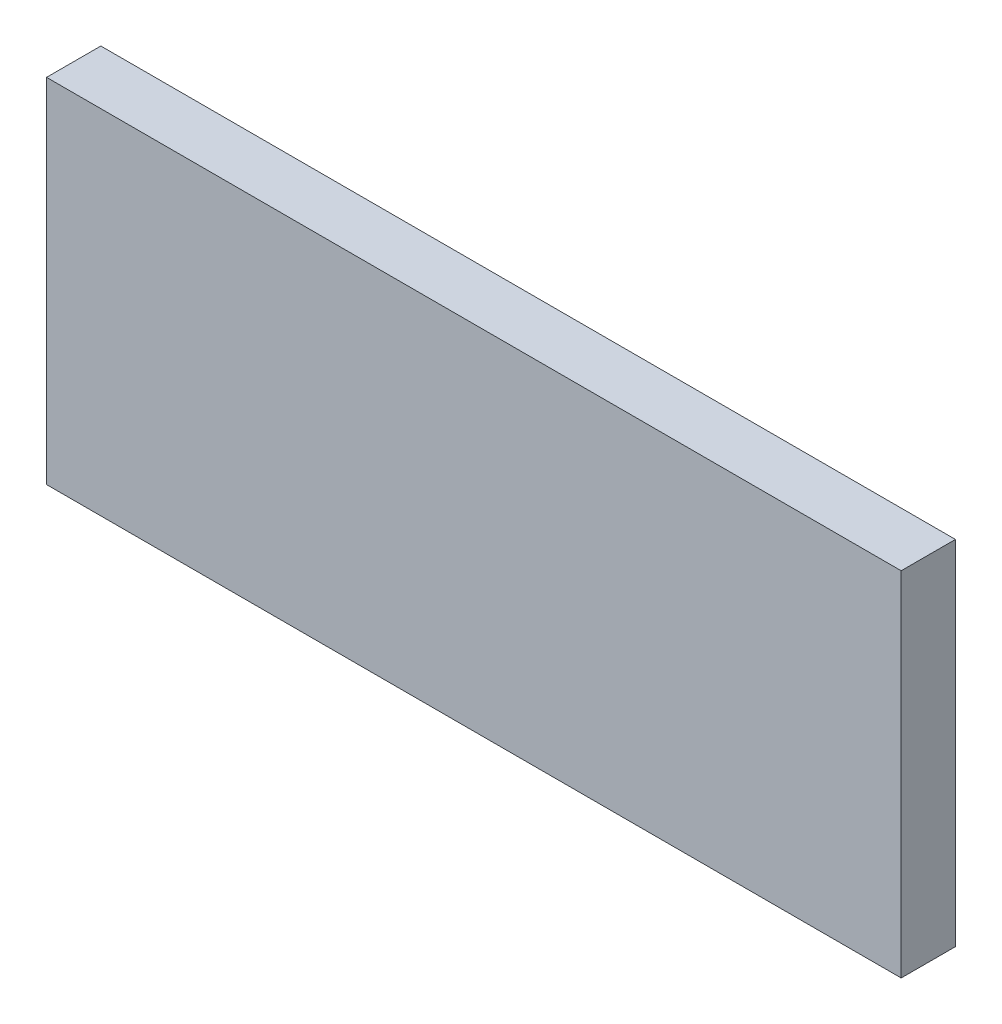
ISO-10303-21;
HEADER;
FILE_DESCRIPTION(('STEP AP214'),'2;1');
FILE_NAME('part.step','',(''),(''),'','','');
FILE_SCHEMA(('AUTOMOTIVE_DESIGN { 1 0 10303 214 1 1 1 1 }'));
ENDSEC;
DATA;
#1=APPLICATION_CONTEXT('core data for automotive mechanical design processes');
#2=APPLICATION_PROTOCOL_DEFINITION('international standard','automotive_design',2000,#1);
#3=PRODUCT_CONTEXT('',#1,'mechanical');
#4=PRODUCT('Part','Part','',(#3));
#5=PRODUCT_RELATED_PRODUCT_CATEGORY('part','',(#4));
#6=PRODUCT_DEFINITION_FORMATION('','',#4);
#7=PRODUCT_DEFINITION_CONTEXT('part definition',#1,'design');
#8=PRODUCT_DEFINITION('design','',#6,#7);
#9=PRODUCT_DEFINITION_SHAPE('','',#8);
#10=(LENGTH_UNIT() NAMED_UNIT(*) SI_UNIT(.MILLI.,.METRE.));
#11=(NAMED_UNIT(*) PLANE_ANGLE_UNIT() SI_UNIT($,.RADIAN.));
#12=(NAMED_UNIT(*) SI_UNIT($,.STERADIAN.) SOLID_ANGLE_UNIT());
#13=UNCERTAINTY_MEASURE_WITH_UNIT(LENGTH_MEASURE(1.E-05),#10,'distance_accuracy_value','');
#14=(GEOMETRIC_REPRESENTATION_CONTEXT(3) GLOBAL_UNCERTAINTY_ASSIGNED_CONTEXT((#13)) GLOBAL_UNIT_ASSIGNED_CONTEXT((#10,
#11,#12)) REPRESENTATION_CONTEXT('',''));
#15=CARTESIAN_POINT('',(0.,0.,0.));
#16=DIRECTION('',(0.,0.,1.));
#17=DIRECTION('',(1.,0.,0.));
#18=AXIS2_PLACEMENT_3D('',#15,#16,#17);
#19=CARTESIAN_POINT('',(-33.600853382098,9.35087719298246,4.));
#20=DIRECTION('',(1.,0.,0.));
#21=DIRECTION('',(0.,0.,-1.));
#22=AXIS2_PLACEMENT_3D('',#19,#20,#21);
#23=PLANE('',#22);
#24=DIRECTION('',(0.,-1.,0.));
#25=VECTOR('',#24,1.);
#26=CARTESIAN_POINT('',(-33.600853382098,9.35087719298246,0.));
#27=LINE('',#26,#25);
#28=CARTESIAN_POINT('',(-33.600853382098,9.35087719298246,0.));
#29=VERTEX_POINT('',#28);
#30=CARTESIAN_POINT('',(-33.600853382098,-16.6491228070175,0.));
#31=VERTEX_POINT('',#30);
#32=EDGE_CURVE('E96',#29,#31,#27,.T.);
#33=ORIENTED_EDGE('',*,*,#32,.T.);
#34=DIRECTION('',(0.,0.,-1.));
#35=VECTOR('',#34,1.);
#36=CARTESIAN_POINT('',(-33.600853382098,-16.6491228070175,4.));
#37=LINE('',#36,#35);
#38=CARTESIAN_POINT('',(-33.600853382098,-16.6491228070175,4.));
#39=VERTEX_POINT('',#38);
#40=EDGE_CURVE('E11',#39,#31,#37,.T.);
#41=ORIENTED_EDGE('',*,*,#40,.F.);
#42=DIRECTION('',(0.,-1.,0.));
#43=VECTOR('',#42,1.);
#44=CARTESIAN_POINT('',(-33.600853382098,9.35087719298246,4.));
#45=LINE('',#44,#43);
#46=CARTESIAN_POINT('',(-33.600853382098,9.35087719298246,4.));
#47=VERTEX_POINT('',#46);
#48=EDGE_CURVE('E84',#47,#39,#45,.T.);
#49=ORIENTED_EDGE('',*,*,#48,.F.);
#50=DIRECTION('',(0.,0.,-1.));
#51=VECTOR('',#50,1.);
#52=CARTESIAN_POINT('',(-33.600853382098,9.35087719298246,4.));
#53=LINE('',#52,#51);
#54=EDGE_CURVE('E92',#47,#29,#53,.T.);
#55=ORIENTED_EDGE('',*,*,#54,.T.);
#56=EDGE_LOOP('',(#33,#41,#49,#55));
#57=FACE_BOUND('',#56,.T.);
#58=ADVANCED_FACE('F33',(#57),#23,.F.);
#59=CARTESIAN_POINT('',(-33.600853382098,-16.6491228070175,4.));
#60=DIRECTION('',(0.,1.,0.));
#61=DIRECTION('',(0.,0.,1.));
#62=AXIS2_PLACEMENT_3D('',#59,#60,#61);
#63=PLANE('',#62);
#64=DIRECTION('',(1.,0.,0.));
#65=VECTOR('',#64,1.);
#66=CARTESIAN_POINT('',(-33.600853382098,-16.6491228070175,0.));
#67=LINE('',#66,#65);
#68=CARTESIAN_POINT('',(29.399146617902,-16.6491228070175,0.));
#69=VERTEX_POINT('',#68);
#70=EDGE_CURVE('E88',#31,#69,#67,.T.);
#71=ORIENTED_EDGE('',*,*,#70,.T.);
#72=DIRECTION('',(0.,0.,-1.));
#73=VECTOR('',#72,1.);
#74=CARTESIAN_POINT('',(29.399146617902,-16.6491228070175,4.));
#75=LINE('',#74,#73);
#76=CARTESIAN_POINT('',(29.399146617902,-16.6491228070175,4.));
#77=VERTEX_POINT('',#76);
#78=EDGE_CURVE('E41',#77,#69,#75,.T.);
#79=ORIENTED_EDGE('',*,*,#78,.F.);
#80=DIRECTION('',(1.,0.,0.));
#81=VECTOR('',#80,1.);
#82=CARTESIAN_POINT('',(-33.600853382098,-16.6491228070175,4.));
#83=LINE('',#82,#81);
#84=EDGE_CURVE('E79',#39,#77,#83,.T.);
#85=ORIENTED_EDGE('',*,*,#84,.F.);
#86=ORIENTED_EDGE('',*,*,#40,.T.);
#87=EDGE_LOOP('',(#71,#79,#85,#86));
#88=FACE_BOUND('',#87,.T.);
#89=ADVANCED_FACE('F87',(#88),#63,.F.);
#90=CARTESIAN_POINT('',(29.399146617902,9.35087719298246,4.));
#91=DIRECTION('',(-1.,0.,0.));
#92=DIRECTION('',(0.,0.,1.));
#93=AXIS2_PLACEMENT_3D('',#90,#91,#92);
#94=PLANE('',#93);
#95=DIRECTION('',(0.,1.,0.));
#96=VECTOR('',#95,1.);
#97=CARTESIAN_POINT('',(29.399146617902,9.35087719298246,0.));
#98=LINE('',#97,#96);
#99=CARTESIAN_POINT('',(29.399146617902,9.35087719298246,0.));
#100=VERTEX_POINT('',#99);
#101=EDGE_CURVE('E66',#69,#100,#98,.T.);
#102=ORIENTED_EDGE('',*,*,#101,.T.);
#103=DIRECTION('',(0.,0.,-1.));
#104=VECTOR('',#103,1.);
#105=CARTESIAN_POINT('',(29.399146617902,9.35087719298246,4.));
#106=LINE('',#105,#104);
#107=CARTESIAN_POINT('',(29.399146617902,9.35087719298246,4.));
#108=VERTEX_POINT('',#107);
#109=EDGE_CURVE('E89',#108,#100,#106,.T.);
#110=ORIENTED_EDGE('',*,*,#109,.F.);
#111=DIRECTION('',(0.,1.,0.));
#112=VECTOR('',#111,1.);
#113=CARTESIAN_POINT('',(29.399146617902,9.35087719298246,4.));
#114=LINE('',#113,#112);
#115=EDGE_CURVE('E82',#77,#108,#114,.T.);
#116=ORIENTED_EDGE('',*,*,#115,.F.);
#117=ORIENTED_EDGE('',*,*,#78,.T.);
#118=EDGE_LOOP('',(#102,#110,#116,#117));
#119=FACE_BOUND('',#118,.T.);
#120=ADVANCED_FACE('F90',(#119),#94,.F.);
#121=CARTESIAN_POINT('',(-33.600853382098,9.35087719298246,4.));
#122=DIRECTION('',(0.,-1.,0.));
#123=DIRECTION('',(0.,0.,-1.));
#124=AXIS2_PLACEMENT_3D('',#121,#122,#123);
#125=PLANE('',#124);
#126=DIRECTION('',(-1.,0.,0.));
#127=VECTOR('',#126,1.);
#128=CARTESIAN_POINT('',(-33.600853382098,9.35087719298246,0.));
#129=LINE('',#128,#127);
#130=EDGE_CURVE('E72',#100,#29,#129,.T.);
#131=ORIENTED_EDGE('',*,*,#130,.T.);
#132=ORIENTED_EDGE('',*,*,#54,.F.);
#133=DIRECTION('',(-1.,0.,0.));
#134=VECTOR('',#133,1.);
#135=CARTESIAN_POINT('',(-33.600853382098,9.35087719298246,4.));
#136=LINE('',#135,#134);
#137=EDGE_CURVE('E49',#108,#47,#136,.T.);
#138=ORIENTED_EDGE('',*,*,#137,.F.);
#139=ORIENTED_EDGE('',*,*,#109,.T.);
#140=EDGE_LOOP('',(#131,#132,#138,#139));
#141=FACE_BOUND('',#140,.T.);
#142=ADVANCED_FACE('F103',(#141),#125,.F.);
#143=CARTESIAN_POINT('',(0.,0.,4.));
#144=DIRECTION('',(0.,0.,1.));
#145=DIRECTION('',(1.,0.,0.));
#146=AXIS2_PLACEMENT_3D('',#143,#144,#145);
#147=PLANE('',#146);
#148=ORIENTED_EDGE('',*,*,#48,.T.);
#149=ORIENTED_EDGE('',*,*,#84,.T.);
#150=ORIENTED_EDGE('',*,*,#115,.T.);
#151=ORIENTED_EDGE('',*,*,#137,.T.);
#152=EDGE_LOOP('',(#148,#149,#150,#151));
#153=FACE_BOUND('',#152,.T.);
#154=ADVANCED_FACE('F80',(#153),#147,.T.);
#155=CARTESIAN_POINT('',(0.,0.,0.));
#156=DIRECTION('',(0.,0.,1.));
#157=DIRECTION('',(1.,0.,0.));
#158=AXIS2_PLACEMENT_3D('',#155,#156,#157);
#159=PLANE('',#158);
#160=ORIENTED_EDGE('',*,*,#32,.F.);
#161=ORIENTED_EDGE('',*,*,#130,.F.);
#162=ORIENTED_EDGE('',*,*,#101,.F.);
#163=ORIENTED_EDGE('',*,*,#70,.F.);
#164=EDGE_LOOP('',(#160,#161,#162,#163));
#165=FACE_BOUND('',#164,.T.);
#166=ADVANCED_FACE('F106',(#165),#159,.F.);
#167=CLOSED_SHELL('',(#58,#89,#120,#142,#154,#166));
#168=MANIFOLD_SOLID_BREP('B2',#167);
#169=ADVANCED_BREP_SHAPE_REPRESENTATION('',(#18,#168),#14);
#170=SHAPE_DEFINITION_REPRESENTATION(#9,#169);
ENDSEC;
END-ISO-10303-21;
